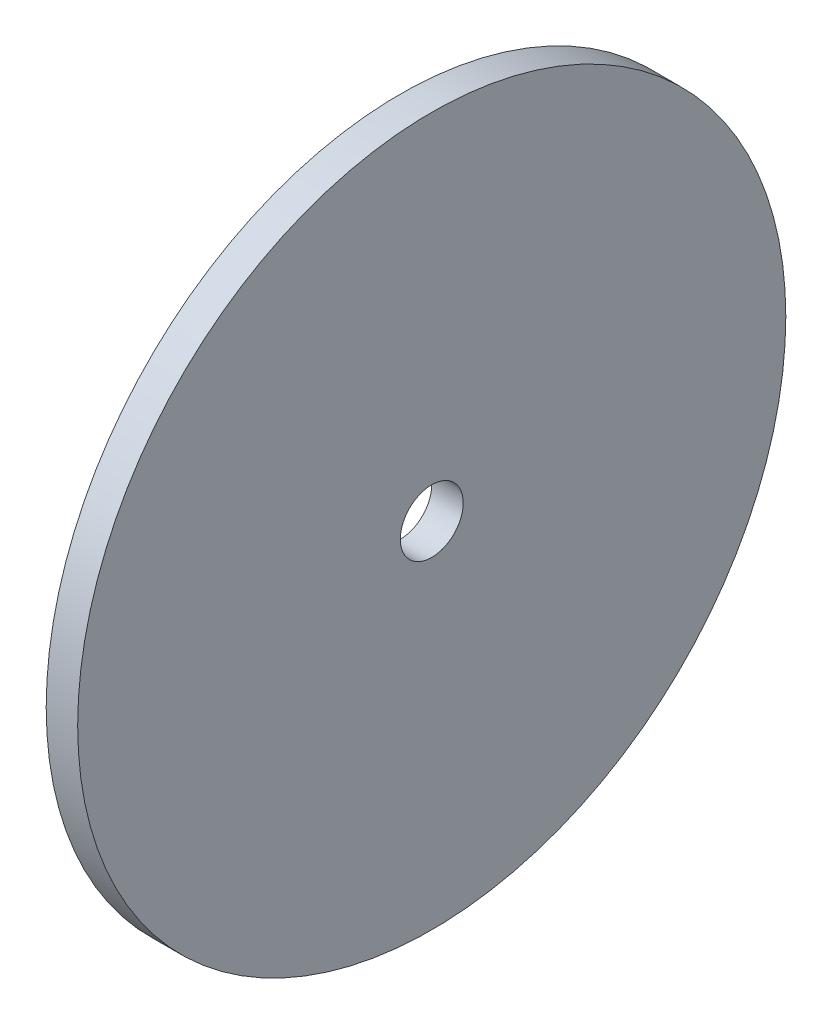
ISO-10303-21;
HEADER;
FILE_DESCRIPTION(('STEP AP214'),'2;1');
FILE_NAME('part.step','',(''),(''),'','','');
FILE_SCHEMA(('AUTOMOTIVE_DESIGN { 1 0 10303 214 1 1 1 1 }'));
ENDSEC;
DATA;
#1=APPLICATION_CONTEXT('core data for automotive mechanical design processes');
#2=APPLICATION_PROTOCOL_DEFINITION('international standard','automotive_design',2000,#1);
#3=PRODUCT_CONTEXT('',#1,'mechanical');
#4=PRODUCT('Part','Part','',(#3));
#5=PRODUCT_RELATED_PRODUCT_CATEGORY('part','',(#4));
#6=PRODUCT_DEFINITION_FORMATION('','',#4);
#7=PRODUCT_DEFINITION_CONTEXT('part definition',#1,'design');
#8=PRODUCT_DEFINITION('design','',#6,#7);
#9=PRODUCT_DEFINITION_SHAPE('','',#8);
#10=(LENGTH_UNIT() NAMED_UNIT(*) SI_UNIT(.MILLI.,.METRE.));
#11=(NAMED_UNIT(*) PLANE_ANGLE_UNIT() SI_UNIT($,.RADIAN.));
#12=(NAMED_UNIT(*) SI_UNIT($,.STERADIAN.) SOLID_ANGLE_UNIT());
#13=UNCERTAINTY_MEASURE_WITH_UNIT(LENGTH_MEASURE(1.E-05),#10,'distance_accuracy_value','');
#14=(GEOMETRIC_REPRESENTATION_CONTEXT(3) GLOBAL_UNCERTAINTY_ASSIGNED_CONTEXT((#13)) GLOBAL_UNIT_ASSIGNED_CONTEXT((#10,
#11,#12)) REPRESENTATION_CONTEXT('',''));
#15=CARTESIAN_POINT('',(0.,0.,0.));
#16=DIRECTION('',(0.,0.,1.));
#17=DIRECTION('',(1.,0.,0.));
#18=AXIS2_PLACEMENT_3D('',#15,#16,#17);
#19=CARTESIAN_POINT('',(2.,0.,0.));
#20=DIRECTION('',(1.,0.,0.));
#21=DIRECTION('',(0.,0.,-1.));
#22=AXIS2_PLACEMENT_3D('',#19,#20,#21);
#23=PLANE('',#22);
#24=CARTESIAN_POINT('',(2.,0.,0.));
#25=DIRECTION('',(1.,0.,0.));
#26=DIRECTION('',(0.,0.,-1.));
#27=AXIS2_PLACEMENT_3D('',#24,#25,#26);
#28=CIRCLE('',#27,45.);
#29=CARTESIAN_POINT('',(2.,0.,-45.));
#30=VERTEX_POINT('',#29);
#31=EDGE_CURVE('E10',#30,#30,#28,.T.);
#32=ORIENTED_EDGE('',*,*,#31,.T.);
#33=EDGE_LOOP('',(#32));
#34=FACE_BOUND('',#33,.T.);
#35=CARTESIAN_POINT('',(2.,0.,0.));
#36=DIRECTION('',(1.,0.,0.));
#37=DIRECTION('',(0.,0.,-1.));
#38=AXIS2_PLACEMENT_3D('',#35,#36,#37);
#39=CIRCLE('',#38,4.);
#40=CARTESIAN_POINT('',(2.,0.,-4.));
#41=VERTEX_POINT('',#40);
#42=EDGE_CURVE('E56',#41,#41,#39,.T.);
#43=ORIENTED_EDGE('',*,*,#42,.F.);
#44=EDGE_LOOP('',(#43));
#45=FACE_BOUND('',#44,.T.);
#46=ADVANCED_FACE('F43',(#34,#45),#23,.T.);
#47=CARTESIAN_POINT('',(-2.,0.,0.));
#48=DIRECTION('',(1.,0.,0.));
#49=DIRECTION('',(0.,0.,-1.));
#50=AXIS2_PLACEMENT_3D('',#47,#48,#49);
#51=PLANE('',#50);
#52=CARTESIAN_POINT('',(-2.,0.,0.));
#53=DIRECTION('',(1.,0.,0.));
#54=DIRECTION('',(0.,0.,-1.));
#55=AXIS2_PLACEMENT_3D('',#52,#53,#54);
#56=CIRCLE('',#55,45.);
#57=CARTESIAN_POINT('',(-2.,0.,-45.));
#58=VERTEX_POINT('',#57);
#59=EDGE_CURVE('E47',#58,#58,#56,.T.);
#60=ORIENTED_EDGE('',*,*,#59,.F.);
#61=EDGE_LOOP('',(#60));
#62=FACE_BOUND('',#61,.T.);
#63=CARTESIAN_POINT('',(-2.,0.,0.));
#64=DIRECTION('',(1.,0.,0.));
#65=DIRECTION('',(0.,0.,-1.));
#66=AXIS2_PLACEMENT_3D('',#63,#64,#65);
#67=CIRCLE('',#66,4.);
#68=CARTESIAN_POINT('',(-2.,0.,-4.));
#69=VERTEX_POINT('',#68);
#70=EDGE_CURVE('E58',#69,#69,#67,.T.);
#71=ORIENTED_EDGE('',*,*,#70,.T.);
#72=EDGE_LOOP('',(#71));
#73=FACE_BOUND('',#72,.T.);
#74=ADVANCED_FACE('F70',(#62,#73),#51,.F.);
#75=CARTESIAN_POINT('',(2.,0.,0.));
#76=DIRECTION('',(-1.,0.,0.));
#77=DIRECTION('',(0.,0.,1.));
#78=AXIS2_PLACEMENT_3D('',#75,#76,#77);
#79=CYLINDRICAL_SURFACE('',#78,45.);
#80=ORIENTED_EDGE('',*,*,#31,.F.);
#81=EDGE_LOOP('',(#80));
#82=FACE_BOUND('',#81,.T.);
#83=ORIENTED_EDGE('',*,*,#59,.T.);
#84=EDGE_LOOP('',(#83));
#85=FACE_BOUND('',#84,.T.);
#86=ADVANCED_FACE('F45',(#82,#85),#79,.T.);
#87=CARTESIAN_POINT('',(2.,0.,0.));
#88=DIRECTION('',(-1.,0.,0.));
#89=DIRECTION('',(0.,0.,1.));
#90=AXIS2_PLACEMENT_3D('',#87,#88,#89);
#91=CYLINDRICAL_SURFACE('',#90,4.);
#92=ORIENTED_EDGE('',*,*,#42,.T.);
#93=EDGE_LOOP('',(#92));
#94=FACE_BOUND('',#93,.T.);
#95=ORIENTED_EDGE('',*,*,#70,.F.);
#96=EDGE_LOOP('',(#95));
#97=FACE_BOUND('',#96,.T.);
#98=ADVANCED_FACE('F66',(#94,#97),#91,.F.);
#99=CLOSED_SHELL('',(#46,#74,#86,#98));
#100=MANIFOLD_SOLID_BREP('B2',#99);
#101=ADVANCED_BREP_SHAPE_REPRESENTATION('',(#18,#100),#14);
#102=SHAPE_DEFINITION_REPRESENTATION(#9,#101);
ENDSEC;
END-ISO-10303-21;
